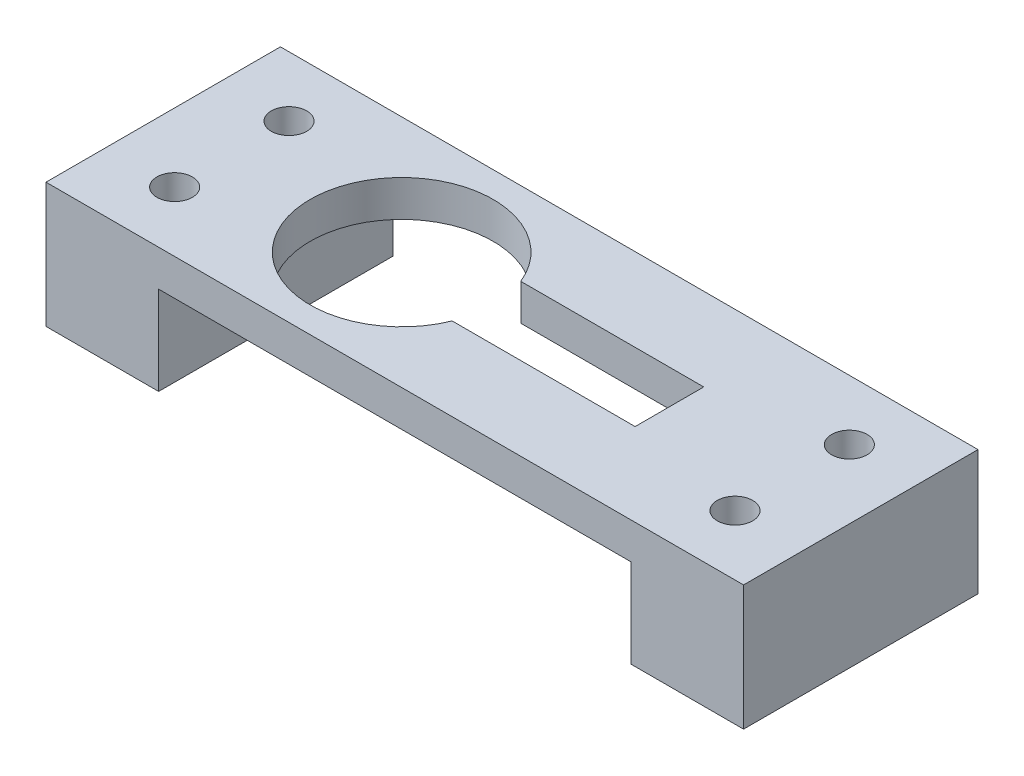
ISO-10303-21;
HEADER;
FILE_DESCRIPTION(('STEP AP214'),'2;1');
FILE_NAME('part.step','',(''),(''),'','','');
FILE_SCHEMA(('AUTOMOTIVE_DESIGN { 1 0 10303 214 1 1 1 1 }'));
ENDSEC;
DATA;
#1=APPLICATION_CONTEXT('core data for automotive mechanical design processes');
#2=APPLICATION_PROTOCOL_DEFINITION('international standard','automotive_design',2000,#1);
#3=PRODUCT_CONTEXT('',#1,'mechanical');
#4=PRODUCT('Part','Part','',(#3));
#5=PRODUCT_RELATED_PRODUCT_CATEGORY('part','',(#4));
#6=PRODUCT_DEFINITION_FORMATION('','',#4);
#7=PRODUCT_DEFINITION_CONTEXT('part definition',#1,'design');
#8=PRODUCT_DEFINITION('design','',#6,#7);
#9=PRODUCT_DEFINITION_SHAPE('','',#8);
#10=(LENGTH_UNIT() NAMED_UNIT(*) SI_UNIT(.MILLI.,.METRE.));
#11=(NAMED_UNIT(*) PLANE_ANGLE_UNIT() SI_UNIT($,.RADIAN.));
#12=(NAMED_UNIT(*) SI_UNIT($,.STERADIAN.) SOLID_ANGLE_UNIT());
#13=UNCERTAINTY_MEASURE_WITH_UNIT(LENGTH_MEASURE(1.E-05),#10,'distance_accuracy_value','');
#14=(GEOMETRIC_REPRESENTATION_CONTEXT(3) GLOBAL_UNCERTAINTY_ASSIGNED_CONTEXT((#13)) GLOBAL_UNIT_ASSIGNED_CONTEXT((#10,
#11,#12)) REPRESENTATION_CONTEXT('',''));
#15=CARTESIAN_POINT('',(0.,0.,0.));
#16=DIRECTION('',(0.,0.,1.));
#17=DIRECTION('',(1.,0.,0.));
#18=AXIS2_PLACEMENT_3D('',#15,#16,#17);
#19=CARTESIAN_POINT('',(0.,0.,0.));
#20=DIRECTION('',(0.,1.,0.));
#21=DIRECTION('',(0.,0.,1.));
#22=AXIS2_PLACEMENT_3D('',#19,#20,#21);
#23=PLANE('',#22);
#24=CARTESIAN_POINT('',(-9.65,0.,0.));
#25=DIRECTION('',(0.,1.,0.));
#26=DIRECTION('',(0.,0.,1.));
#27=AXIS2_PLACEMENT_3D('',#24,#25,#26);
#28=CIRCLE('',#27,8.);
#29=CARTESIAN_POINT('',(-2.23380151290434,0.,-3.));
#30=VERTEX_POINT('',#29);
#31=CARTESIAN_POINT('',(-2.23380151290434,0.,3.));
#32=VERTEX_POINT('',#31);
#33=EDGE_CURVE('E136',#30,#32,#28,.T.);
#34=ORIENTED_EDGE('',*,*,#33,.T.);
#35=DIRECTION('',(1.,0.,0.));
#36=VECTOR('',#35,1.);
#37=CARTESIAN_POINT('',(0.,0.,3.));
#38=LINE('',#37,#36);
#39=CARTESIAN_POINT('',(13.7661984870957,0.,3.));
#40=VERTEX_POINT('',#39);
#41=EDGE_CURVE('E145',#32,#40,#38,.T.);
#42=ORIENTED_EDGE('',*,*,#41,.T.);
#43=DIRECTION('',(0.,0.,1.));
#44=VECTOR('',#43,1.);
#45=CARTESIAN_POINT('',(13.7661984870957,0.,0.));
#46=LINE('',#45,#44);
#47=CARTESIAN_POINT('',(13.7661984870957,0.,-3.));
#48=VERTEX_POINT('',#47);
#49=EDGE_CURVE('E142',#48,#40,#46,.T.);
#50=ORIENTED_EDGE('',*,*,#49,.F.);
#51=DIRECTION('',(1.,0.,0.));
#52=VECTOR('',#51,1.);
#53=CARTESIAN_POINT('',(0.,0.,-3.));
#54=LINE('',#53,#52);
#55=EDGE_CURVE('E138',#30,#48,#54,.T.);
#56=ORIENTED_EDGE('',*,*,#55,.F.);
#57=EDGE_LOOP('',(#34,#42,#50,#56));
#58=FACE_BOUND('',#57,.T.);
#59=DIRECTION('',(0.,0.,-1.));
#60=VECTOR('',#59,1.);
#61=CARTESIAN_POINT('',(20.65,0.,10.25));
#62=LINE('',#61,#60);
#63=CARTESIAN_POINT('',(20.65,0.,10.25));
#64=VERTEX_POINT('',#63);
#65=CARTESIAN_POINT('',(20.65,0.,-10.25));
#66=VERTEX_POINT('',#65);
#67=EDGE_CURVE('E257',#64,#66,#62,.T.);
#68=ORIENTED_EDGE('',*,*,#67,.F.);
#69=DIRECTION('',(1.,0.,0.));
#70=VECTOR('',#69,1.);
#71=CARTESIAN_POINT('',(0.,0.,10.25));
#72=LINE('',#71,#70);
#73=CARTESIAN_POINT('',(-20.65,0.,10.25));
#74=VERTEX_POINT('',#73);
#75=EDGE_CURVE('E150',#74,#64,#72,.T.);
#76=ORIENTED_EDGE('',*,*,#75,.F.);
#77=DIRECTION('',(0.,0.,1.));
#78=VECTOR('',#77,1.);
#79=CARTESIAN_POINT('',(-20.65,0.,10.25));
#80=LINE('',#79,#78);
#81=CARTESIAN_POINT('',(-20.65,0.,-10.25));
#82=VERTEX_POINT('',#81);
#83=EDGE_CURVE('E54',#82,#74,#80,.T.);
#84=ORIENTED_EDGE('',*,*,#83,.F.);
#85=DIRECTION('',(1.,0.,0.));
#86=VECTOR('',#85,1.);
#87=CARTESIAN_POINT('',(0.,0.,-10.25));
#88=LINE('',#87,#86);
#89=EDGE_CURVE('E148',#82,#66,#88,.T.);
#90=ORIENTED_EDGE('',*,*,#89,.T.);
#91=EDGE_LOOP('',(#68,#76,#84,#90));
#92=FACE_BOUND('',#91,.T.);
#93=ADVANCED_FACE('F37',(#58,#92),#23,.F.);
#94=CARTESIAN_POINT('',(30.5,3.175,0.));
#95=DIRECTION('',(1.,0.,0.));
#96=DIRECTION('',(0.,0.,-1.));
#97=AXIS2_PLACEMENT_3D('',#94,#95,#96);
#98=PLANE('',#97);
#99=DIRECTION('',(0.,-1.,0.));
#100=VECTOR('',#99,1.);
#101=CARTESIAN_POINT('',(30.5,3.175,10.25));
#102=LINE('',#101,#100);
#103=CARTESIAN_POINT('',(30.5,3.175,10.25));
#104=VERTEX_POINT('',#103);
#105=CARTESIAN_POINT('',(30.5,-7.75,10.25));
#106=VERTEX_POINT('',#105);
#107=EDGE_CURVE('E154',#104,#106,#102,.T.);
#108=ORIENTED_EDGE('',*,*,#107,.T.);
#109=DIRECTION('',(0.,0.,1.));
#110=VECTOR('',#109,1.);
#111=CARTESIAN_POINT('',(30.5,-7.75,-10.25));
#112=LINE('',#111,#110);
#113=CARTESIAN_POINT('',(30.5,-7.75,-10.25));
#114=VERTEX_POINT('',#113);
#115=EDGE_CURVE('E256',#114,#106,#112,.T.);
#116=ORIENTED_EDGE('',*,*,#115,.F.);
#117=DIRECTION('',(0.,-1.,0.));
#118=VECTOR('',#117,1.);
#119=CARTESIAN_POINT('',(30.5,3.175,-10.25));
#120=LINE('',#119,#118);
#121=CARTESIAN_POINT('',(30.5,3.175,-10.25));
#122=VERTEX_POINT('',#121);
#123=EDGE_CURVE('E11',#122,#114,#120,.T.);
#124=ORIENTED_EDGE('',*,*,#123,.F.);
#125=DIRECTION('',(0.,0.,1.));
#126=VECTOR('',#125,1.);
#127=CARTESIAN_POINT('',(30.5,3.175,0.));
#128=LINE('',#127,#126);
#129=EDGE_CURVE('E129',#122,#104,#128,.T.);
#130=ORIENTED_EDGE('',*,*,#129,.T.);
#131=EDGE_LOOP('',(#108,#116,#124,#130));
#132=FACE_BOUND('',#131,.T.);
#133=ADVANCED_FACE('F184',(#132),#98,.T.);
#134=CARTESIAN_POINT('',(0.,3.175,-10.25));
#135=DIRECTION('',(0.,0.,-1.));
#136=DIRECTION('',(-1.,0.,0.));
#137=AXIS2_PLACEMENT_3D('',#134,#135,#136);
#138=PLANE('',#137);
#139=ORIENTED_EDGE('',*,*,#89,.F.);
#140=DIRECTION('',(0.,1.,0.));
#141=VECTOR('',#140,1.);
#142=CARTESIAN_POINT('',(-20.65,-7.75,-10.25));
#143=LINE('',#142,#141);
#144=CARTESIAN_POINT('',(-20.65,-7.75,-10.25));
#145=VERTEX_POINT('',#144);
#146=EDGE_CURVE('E139',#145,#82,#143,.T.);
#147=ORIENTED_EDGE('',*,*,#146,.F.);
#148=DIRECTION('',(1.,0.,0.));
#149=VECTOR('',#148,1.);
#150=CARTESIAN_POINT('',(-20.65,-7.75,-10.25));
#151=LINE('',#150,#149);
#152=CARTESIAN_POINT('',(-30.5,-7.75,-10.25));
#153=VERTEX_POINT('',#152);
#154=EDGE_CURVE('E116',#153,#145,#151,.T.);
#155=ORIENTED_EDGE('',*,*,#154,.F.);
#156=DIRECTION('',(0.,-1.,0.));
#157=VECTOR('',#156,1.);
#158=CARTESIAN_POINT('',(-30.5,3.175,-10.25));
#159=LINE('',#158,#157);
#160=CARTESIAN_POINT('',(-30.5,3.175,-10.25));
#161=VERTEX_POINT('',#160);
#162=EDGE_CURVE('E46',#161,#153,#159,.T.);
#163=ORIENTED_EDGE('',*,*,#162,.F.);
#164=DIRECTION('',(1.,0.,0.));
#165=VECTOR('',#164,1.);
#166=CARTESIAN_POINT('',(0.,3.175,-10.25));
#167=LINE('',#166,#165);
#168=EDGE_CURVE('E112',#161,#122,#167,.T.);
#169=ORIENTED_EDGE('',*,*,#168,.T.);
#170=ORIENTED_EDGE('',*,*,#123,.T.);
#171=DIRECTION('',(1.,0.,0.));
#172=VECTOR('',#171,1.);
#173=CARTESIAN_POINT('',(20.65,-7.75,-10.25));
#174=LINE('',#173,#172);
#175=CARTESIAN_POINT('',(20.65,-7.75,-10.25));
#176=VERTEX_POINT('',#175);
#177=EDGE_CURVE('E264',#176,#114,#174,.T.);
#178=ORIENTED_EDGE('',*,*,#177,.F.);
#179=DIRECTION('',(0.,1.,0.));
#180=VECTOR('',#179,1.);
#181=CARTESIAN_POINT('',(20.65,-7.75,-10.25));
#182=LINE('',#181,#180);
#183=EDGE_CURVE('E253',#176,#66,#182,.T.);
#184=ORIENTED_EDGE('',*,*,#183,.T.);
#185=EDGE_LOOP('',(#139,#147,#155,#163,#169,#170,#178,#184));
#186=FACE_BOUND('',#185,.T.);
#187=ADVANCED_FACE('F110',(#186),#138,.T.);
#188=CARTESIAN_POINT('',(-30.5,3.175,0.));
#189=DIRECTION('',(1.,0.,0.));
#190=DIRECTION('',(0.,0.,-1.));
#191=AXIS2_PLACEMENT_3D('',#188,#189,#190);
#192=PLANE('',#191);
#193=ORIENTED_EDGE('',*,*,#162,.T.);
#194=DIRECTION('',(0.,0.,-1.));
#195=VECTOR('',#194,1.);
#196=CARTESIAN_POINT('',(-30.5,-7.75,-10.25));
#197=LINE('',#196,#195);
#198=CARTESIAN_POINT('',(-30.5,-7.75,10.25));
#199=VERTEX_POINT('',#198);
#200=EDGE_CURVE('E241',#199,#153,#197,.T.);
#201=ORIENTED_EDGE('',*,*,#200,.F.);
#202=DIRECTION('',(0.,-1.,0.));
#203=VECTOR('',#202,1.);
#204=CARTESIAN_POINT('',(-30.5,3.175,10.25));
#205=LINE('',#204,#203);
#206=CARTESIAN_POINT('',(-30.5,3.175,10.25));
#207=VERTEX_POINT('',#206);
#208=EDGE_CURVE('E120',#207,#199,#205,.T.);
#209=ORIENTED_EDGE('',*,*,#208,.F.);
#210=DIRECTION('',(0.,0.,1.));
#211=VECTOR('',#210,1.);
#212=CARTESIAN_POINT('',(-30.5,3.175,0.));
#213=LINE('',#212,#211);
#214=EDGE_CURVE('E123',#161,#207,#213,.T.);
#215=ORIENTED_EDGE('',*,*,#214,.F.);
#216=EDGE_LOOP('',(#193,#201,#209,#215));
#217=FACE_BOUND('',#216,.T.);
#218=ADVANCED_FACE('F124',(#217),#192,.F.);
#219=CARTESIAN_POINT('',(-9.65,3.175,0.));
#220=DIRECTION('',(0.,-1.,0.));
#221=DIRECTION('',(0.,0.,-1.));
#222=AXIS2_PLACEMENT_3D('',#219,#220,#221);
#223=CYLINDRICAL_SURFACE('',#222,8.);
#224=ORIENTED_EDGE('',*,*,#33,.F.);
#225=DIRECTION('',(0.,-1.,0.));
#226=VECTOR('',#225,1.);
#227=CARTESIAN_POINT('',(-2.23380151290434,3.175,-3.));
#228=LINE('',#227,#226);
#229=CARTESIAN_POINT('',(-2.23380151290434,3.175,-3.));
#230=VERTEX_POINT('',#229);
#231=EDGE_CURVE('E41',#230,#30,#228,.T.);
#232=ORIENTED_EDGE('',*,*,#231,.F.);
#233=CARTESIAN_POINT('',(-9.65,3.175,0.));
#234=DIRECTION('',(0.,1.,0.));
#235=DIRECTION('',(0.,0.,1.));
#236=AXIS2_PLACEMENT_3D('',#233,#234,#235);
#237=CIRCLE('',#236,8.);
#238=CARTESIAN_POINT('',(-2.23380151290434,3.175,3.));
#239=VERTEX_POINT('',#238);
#240=EDGE_CURVE('E216',#230,#239,#237,.T.);
#241=ORIENTED_EDGE('',*,*,#240,.T.);
#242=DIRECTION('',(0.,-1.,0.));
#243=VECTOR('',#242,1.);
#244=CARTESIAN_POINT('',(-2.23380151290434,3.175,3.));
#245=LINE('',#244,#243);
#246=EDGE_CURVE('E85',#239,#32,#245,.T.);
#247=ORIENTED_EDGE('',*,*,#246,.T.);
#248=EDGE_LOOP('',(#224,#232,#241,#247));
#249=FACE_BOUND('',#248,.T.);
#250=ADVANCED_FACE('F172',(#249),#223,.F.);
#251=CARTESIAN_POINT('',(0.,3.175,-3.));
#252=DIRECTION('',(0.,0.,-1.));
#253=DIRECTION('',(-1.,0.,0.));
#254=AXIS2_PLACEMENT_3D('',#251,#252,#253);
#255=PLANE('',#254);
#256=ORIENTED_EDGE('',*,*,#55,.T.);
#257=DIRECTION('',(0.,-1.,0.));
#258=VECTOR('',#257,1.);
#259=CARTESIAN_POINT('',(13.7661984870957,3.175,-3.));
#260=LINE('',#259,#258);
#261=CARTESIAN_POINT('',(13.7661984870957,3.175,-3.));
#262=VERTEX_POINT('',#261);
#263=EDGE_CURVE('E160',#262,#48,#260,.T.);
#264=ORIENTED_EDGE('',*,*,#263,.F.);
#265=DIRECTION('',(1.,0.,0.));
#266=VECTOR('',#265,1.);
#267=CARTESIAN_POINT('',(0.,3.175,-3.));
#268=LINE('',#267,#266);
#269=EDGE_CURVE('E168',#230,#262,#268,.T.);
#270=ORIENTED_EDGE('',*,*,#269,.F.);
#271=ORIENTED_EDGE('',*,*,#231,.T.);
#272=EDGE_LOOP('',(#256,#264,#270,#271));
#273=FACE_BOUND('',#272,.T.);
#274=ADVANCED_FACE('F166',(#273),#255,.F.);
#275=CARTESIAN_POINT('',(13.7661984870957,3.175,0.));
#276=DIRECTION('',(1.,0.,0.));
#277=DIRECTION('',(0.,0.,-1.));
#278=AXIS2_PLACEMENT_3D('',#275,#276,#277);
#279=PLANE('',#278);
#280=ORIENTED_EDGE('',*,*,#49,.T.);
#281=DIRECTION('',(0.,-1.,0.));
#282=VECTOR('',#281,1.);
#283=CARTESIAN_POINT('',(13.7661984870957,3.175,3.));
#284=LINE('',#283,#282);
#285=CARTESIAN_POINT('',(13.7661984870957,3.175,3.));
#286=VERTEX_POINT('',#285);
#287=EDGE_CURVE('E159',#286,#40,#284,.T.);
#288=ORIENTED_EDGE('',*,*,#287,.F.);
#289=DIRECTION('',(0.,0.,1.));
#290=VECTOR('',#289,1.);
#291=CARTESIAN_POINT('',(13.7661984870957,3.175,0.));
#292=LINE('',#291,#290);
#293=EDGE_CURVE('E212',#262,#286,#292,.T.);
#294=ORIENTED_EDGE('',*,*,#293,.F.);
#295=ORIENTED_EDGE('',*,*,#263,.T.);
#296=EDGE_LOOP('',(#280,#288,#294,#295));
#297=FACE_BOUND('',#296,.T.);
#298=ADVANCED_FACE('F179',(#297),#279,.F.);
#299=CARTESIAN_POINT('',(0.,3.175,3.));
#300=DIRECTION('',(0.,0.,-1.));
#301=DIRECTION('',(-1.,0.,0.));
#302=AXIS2_PLACEMENT_3D('',#299,#300,#301);
#303=PLANE('',#302);
#304=ORIENTED_EDGE('',*,*,#41,.F.);
#305=ORIENTED_EDGE('',*,*,#246,.F.);
#306=DIRECTION('',(1.,0.,0.));
#307=VECTOR('',#306,1.);
#308=CARTESIAN_POINT('',(0.,3.175,3.));
#309=LINE('',#308,#307);
#310=EDGE_CURVE('E131',#239,#286,#309,.T.);
#311=ORIENTED_EDGE('',*,*,#310,.T.);
#312=ORIENTED_EDGE('',*,*,#287,.T.);
#313=EDGE_LOOP('',(#304,#305,#311,#312));
#314=FACE_BOUND('',#313,.T.);
#315=ADVANCED_FACE('F200',(#314),#303,.T.);
#316=CARTESIAN_POINT('',(-24.5,3.175,-5.));
#317=DIRECTION('',(0.,-1.,0.));
#318=DIRECTION('',(0.,0.,-1.));
#319=AXIS2_PLACEMENT_3D('',#316,#317,#318);
#320=CYLINDRICAL_SURFACE('',#319,1.55);
#321=CARTESIAN_POINT('',(-24.5,3.175,-5.));
#322=DIRECTION('',(0.,1.,0.));
#323=DIRECTION('',(0.,0.,1.));
#324=AXIS2_PLACEMENT_3D('',#321,#322,#323);
#325=CIRCLE('',#324,1.55);
#326=CARTESIAN_POINT('',(-24.5,3.175,-3.45));
#327=VERTEX_POINT('',#326);
#328=EDGE_CURVE('E218',#327,#327,#325,.T.);
#329=ORIENTED_EDGE('',*,*,#328,.T.);
#330=EDGE_LOOP('',(#329));
#331=FACE_BOUND('',#330,.T.);
#332=CARTESIAN_POINT('',(-24.5,-7.75,-5.));
#333=DIRECTION('',(0.,-1.,0.));
#334=DIRECTION('',(0.,0.,-1.));
#335=AXIS2_PLACEMENT_3D('',#332,#333,#334);
#336=CIRCLE('',#335,1.55);
#337=CARTESIAN_POINT('',(-24.5,-7.75,-6.55));
#338=VERTEX_POINT('',#337);
#339=EDGE_CURVE('E247',#338,#338,#336,.T.);
#340=ORIENTED_EDGE('',*,*,#339,.T.);
#341=EDGE_LOOP('',(#340));
#342=FACE_BOUND('',#341,.T.);
#343=ADVANCED_FACE('F203',(#331,#342),#320,.F.);
#344=CARTESIAN_POINT('',(-24.5,3.175,5.));
#345=DIRECTION('',(0.,-1.,0.));
#346=DIRECTION('',(0.,0.,-1.));
#347=AXIS2_PLACEMENT_3D('',#344,#345,#346);
#348=CYLINDRICAL_SURFACE('',#347,1.55);
#349=CARTESIAN_POINT('',(-24.5,3.175,5.));
#350=DIRECTION('',(0.,1.,0.));
#351=DIRECTION('',(0.,0.,1.));
#352=AXIS2_PLACEMENT_3D('',#349,#350,#351);
#353=CIRCLE('',#352,1.55);
#354=CARTESIAN_POINT('',(-24.5,3.175,6.55));
#355=VERTEX_POINT('',#354);
#356=EDGE_CURVE('E221',#355,#355,#353,.T.);
#357=ORIENTED_EDGE('',*,*,#356,.T.);
#358=EDGE_LOOP('',(#357));
#359=FACE_BOUND('',#358,.T.);
#360=CARTESIAN_POINT('',(-24.5,-7.75,5.));
#361=DIRECTION('',(0.,-1.,0.));
#362=DIRECTION('',(0.,0.,-1.));
#363=AXIS2_PLACEMENT_3D('',#360,#361,#362);
#364=CIRCLE('',#363,1.55);
#365=CARTESIAN_POINT('',(-24.5,-7.75,3.45));
#366=VERTEX_POINT('',#365);
#367=EDGE_CURVE('E237',#366,#366,#364,.T.);
#368=ORIENTED_EDGE('',*,*,#367,.T.);
#369=EDGE_LOOP('',(#368));
#370=FACE_BOUND('',#369,.T.);
#371=ADVANCED_FACE('F310',(#359,#370),#348,.F.);
#372=CARTESIAN_POINT('',(24.5,3.175,-5.00000000000001));
#373=DIRECTION('',(0.,-1.,0.));
#374=DIRECTION('',(0.,0.,-1.));
#375=AXIS2_PLACEMENT_3D('',#372,#373,#374);
#376=CYLINDRICAL_SURFACE('',#375,1.55);
#377=CARTESIAN_POINT('',(24.5,3.175,-5.00000000000001));
#378=DIRECTION('',(0.,1.,0.));
#379=DIRECTION('',(0.,0.,1.));
#380=AXIS2_PLACEMENT_3D('',#377,#378,#379);
#381=CIRCLE('',#380,1.55);
#382=CARTESIAN_POINT('',(24.5,3.175,-3.45000000000001));
#383=VERTEX_POINT('',#382);
#384=EDGE_CURVE('E224',#383,#383,#381,.T.);
#385=ORIENTED_EDGE('',*,*,#384,.T.);
#386=EDGE_LOOP('',(#385));
#387=FACE_BOUND('',#386,.T.);
#388=CARTESIAN_POINT('',(24.5,-7.75,-5.00000000000001));
#389=DIRECTION('',(0.,-1.,0.));
#390=DIRECTION('',(0.,0.,-1.));
#391=AXIS2_PLACEMENT_3D('',#388,#389,#390);
#392=CIRCLE('',#391,1.55);
#393=CARTESIAN_POINT('',(24.5,-7.75,-6.55000000000001));
#394=VERTEX_POINT('',#393);
#395=EDGE_CURVE('E261',#394,#394,#392,.T.);
#396=ORIENTED_EDGE('',*,*,#395,.T.);
#397=EDGE_LOOP('',(#396));
#398=FACE_BOUND('',#397,.T.);
#399=ADVANCED_FACE('F315',(#387,#398),#376,.F.);
#400=CARTESIAN_POINT('',(24.5,3.175,5.00000000000001));
#401=DIRECTION('',(0.,-1.,0.));
#402=DIRECTION('',(0.,0.,-1.));
#403=AXIS2_PLACEMENT_3D('',#400,#401,#402);
#404=CYLINDRICAL_SURFACE('',#403,1.55);
#405=CARTESIAN_POINT('',(24.5,3.175,5.00000000000001));
#406=DIRECTION('',(0.,1.,0.));
#407=DIRECTION('',(0.,0.,1.));
#408=AXIS2_PLACEMENT_3D('',#405,#406,#407);
#409=CIRCLE('',#408,1.55);
#410=CARTESIAN_POINT('',(24.5,3.175,6.55000000000001));
#411=VERTEX_POINT('',#410);
#412=EDGE_CURVE('E153',#411,#411,#409,.T.);
#413=ORIENTED_EDGE('',*,*,#412,.T.);
#414=EDGE_LOOP('',(#413));
#415=FACE_BOUND('',#414,.T.);
#416=CARTESIAN_POINT('',(24.5,-7.75,5.00000000000001));
#417=DIRECTION('',(0.,-1.,0.));
#418=DIRECTION('',(0.,0.,-1.));
#419=AXIS2_PLACEMENT_3D('',#416,#417,#418);
#420=CIRCLE('',#419,1.55);
#421=CARTESIAN_POINT('',(24.5,-7.75,3.45000000000001));
#422=VERTEX_POINT('',#421);
#423=EDGE_CURVE('E274',#422,#422,#420,.T.);
#424=ORIENTED_EDGE('',*,*,#423,.T.);
#425=EDGE_LOOP('',(#424));
#426=FACE_BOUND('',#425,.T.);
#427=ADVANCED_FACE('F39',(#415,#426),#404,.F.);
#428=CARTESIAN_POINT('',(0.,3.175,10.25));
#429=DIRECTION('',(0.,0.,-1.));
#430=DIRECTION('',(-1.,0.,0.));
#431=AXIS2_PLACEMENT_3D('',#428,#429,#430);
#432=PLANE('',#431);
#433=ORIENTED_EDGE('',*,*,#208,.T.);
#434=DIRECTION('',(-1.,0.,0.));
#435=VECTOR('',#434,1.);
#436=CARTESIAN_POINT('',(-30.5,-7.75,10.25));
#437=LINE('',#436,#435);
#438=CARTESIAN_POINT('',(-20.65,-7.75,10.25));
#439=VERTEX_POINT('',#438);
#440=EDGE_CURVE('E236',#439,#199,#437,.T.);
#441=ORIENTED_EDGE('',*,*,#440,.F.);
#442=DIRECTION('',(0.,1.,0.));
#443=VECTOR('',#442,1.);
#444=CARTESIAN_POINT('',(-20.65,-7.75,10.25));
#445=LINE('',#444,#443);
#446=EDGE_CURVE('E231',#439,#74,#445,.T.);
#447=ORIENTED_EDGE('',*,*,#446,.T.);
#448=ORIENTED_EDGE('',*,*,#75,.T.);
#449=DIRECTION('',(0.,1.,0.));
#450=VECTOR('',#449,1.);
#451=CARTESIAN_POINT('',(20.65,-7.75,10.25));
#452=LINE('',#451,#450);
#453=CARTESIAN_POINT('',(20.65,-7.75,10.25));
#454=VERTEX_POINT('',#453);
#455=EDGE_CURVE('E250',#454,#64,#452,.T.);
#456=ORIENTED_EDGE('',*,*,#455,.F.);
#457=DIRECTION('',(-1.,0.,0.));
#458=VECTOR('',#457,1.);
#459=CARTESIAN_POINT('',(30.5,-7.75,10.25));
#460=LINE('',#459,#458);
#461=EDGE_CURVE('E260',#106,#454,#460,.T.);
#462=ORIENTED_EDGE('',*,*,#461,.F.);
#463=ORIENTED_EDGE('',*,*,#107,.F.);
#464=DIRECTION('',(1.,0.,0.));
#465=VECTOR('',#464,1.);
#466=CARTESIAN_POINT('',(0.,3.175,10.25));
#467=LINE('',#466,#465);
#468=EDGE_CURVE('E63',#207,#104,#467,.T.);
#469=ORIENTED_EDGE('',*,*,#468,.F.);
#470=EDGE_LOOP('',(#433,#441,#447,#448,#456,#462,#463,#469));
#471=FACE_BOUND('',#470,.T.);
#472=ADVANCED_FACE('F194',(#471),#432,.F.);
#473=CARTESIAN_POINT('',(0.,3.175,0.));
#474=DIRECTION('',(0.,1.,0.));
#475=DIRECTION('',(0.,0.,1.));
#476=AXIS2_PLACEMENT_3D('',#473,#474,#475);
#477=PLANE('',#476);
#478=ORIENTED_EDGE('',*,*,#412,.F.);
#479=EDGE_LOOP('',(#478));
#480=FACE_BOUND('',#479,.T.);
#481=ORIENTED_EDGE('',*,*,#384,.F.);
#482=EDGE_LOOP('',(#481));
#483=FACE_BOUND('',#482,.T.);
#484=ORIENTED_EDGE('',*,*,#356,.F.);
#485=EDGE_LOOP('',(#484));
#486=FACE_BOUND('',#485,.T.);
#487=ORIENTED_EDGE('',*,*,#328,.F.);
#488=EDGE_LOOP('',(#487));
#489=FACE_BOUND('',#488,.T.);
#490=ORIENTED_EDGE('',*,*,#240,.F.);
#491=ORIENTED_EDGE('',*,*,#269,.T.);
#492=ORIENTED_EDGE('',*,*,#293,.T.);
#493=ORIENTED_EDGE('',*,*,#310,.F.);
#494=EDGE_LOOP('',(#490,#491,#492,#493));
#495=FACE_BOUND('',#494,.T.);
#496=ORIENTED_EDGE('',*,*,#129,.F.);
#497=ORIENTED_EDGE('',*,*,#168,.F.);
#498=ORIENTED_EDGE('',*,*,#214,.T.);
#499=ORIENTED_EDGE('',*,*,#468,.T.);
#500=EDGE_LOOP('',(#496,#497,#498,#499));
#501=FACE_BOUND('',#500,.T.);
#502=ADVANCED_FACE('F127',(#480,#483,#486,#489,#495,#501),#477,.T.);
#503=CARTESIAN_POINT('',(0.,-7.75,0.));
#504=DIRECTION('',(0.,1.,0.));
#505=DIRECTION('',(0.,0.,1.));
#506=AXIS2_PLACEMENT_3D('',#503,#504,#505);
#507=PLANE('',#506);
#508=ORIENTED_EDGE('',*,*,#440,.T.);
#509=ORIENTED_EDGE('',*,*,#200,.T.);
#510=ORIENTED_EDGE('',*,*,#154,.T.);
#511=DIRECTION('',(0.,0.,1.));
#512=VECTOR('',#511,1.);
#513=CARTESIAN_POINT('',(-20.65,-7.75,10.25));
#514=LINE('',#513,#512);
#515=EDGE_CURVE('E234',#145,#439,#514,.T.);
#516=ORIENTED_EDGE('',*,*,#515,.T.);
#517=EDGE_LOOP('',(#508,#509,#510,#516));
#518=FACE_BOUND('',#517,.T.);
#519=ORIENTED_EDGE('',*,*,#367,.F.);
#520=EDGE_LOOP('',(#519));
#521=FACE_BOUND('',#520,.T.);
#522=ORIENTED_EDGE('',*,*,#339,.F.);
#523=EDGE_LOOP('',(#522));
#524=FACE_BOUND('',#523,.T.);
#525=ADVANCED_FACE('F291',(#518,#521,#524),#507,.F.);
#526=CARTESIAN_POINT('',(-20.65,-7.75,10.25));
#527=DIRECTION('',(-1.,0.,0.));
#528=DIRECTION('',(0.,0.,1.));
#529=AXIS2_PLACEMENT_3D('',#526,#527,#528);
#530=PLANE('',#529);
#531=ORIENTED_EDGE('',*,*,#83,.T.);
#532=ORIENTED_EDGE('',*,*,#446,.F.);
#533=ORIENTED_EDGE('',*,*,#515,.F.);
#534=ORIENTED_EDGE('',*,*,#146,.T.);
#535=EDGE_LOOP('',(#531,#532,#533,#534));
#536=FACE_BOUND('',#535,.T.);
#537=ADVANCED_FACE('F282',(#536),#530,.F.);
#538=CARTESIAN_POINT('',(0.,-7.75,0.));
#539=DIRECTION('',(0.,-1.,0.));
#540=DIRECTION('',(0.,0.,-1.));
#541=AXIS2_PLACEMENT_3D('',#538,#539,#540);
#542=PLANE('',#541);
#543=ORIENTED_EDGE('',*,*,#395,.F.);
#544=EDGE_LOOP('',(#543));
#545=FACE_BOUND('',#544,.T.);
#546=ORIENTED_EDGE('',*,*,#461,.T.);
#547=DIRECTION('',(0.,0.,-1.));
#548=VECTOR('',#547,1.);
#549=CARTESIAN_POINT('',(20.65,-7.75,10.25));
#550=LINE('',#549,#548);
#551=EDGE_CURVE('E267',#454,#176,#550,.T.);
#552=ORIENTED_EDGE('',*,*,#551,.T.);
#553=ORIENTED_EDGE('',*,*,#177,.T.);
#554=ORIENTED_EDGE('',*,*,#115,.T.);
#555=EDGE_LOOP('',(#546,#552,#553,#554));
#556=FACE_BOUND('',#555,.T.);
#557=ORIENTED_EDGE('',*,*,#423,.F.);
#558=EDGE_LOOP('',(#557));
#559=FACE_BOUND('',#558,.T.);
#560=ADVANCED_FACE('F279',(#545,#556,#559),#542,.T.);
#561=CARTESIAN_POINT('',(20.65,-7.75,10.25));
#562=DIRECTION('',(1.,0.,0.));
#563=DIRECTION('',(0.,0.,-1.));
#564=AXIS2_PLACEMENT_3D('',#561,#562,#563);
#565=PLANE('',#564);
#566=ORIENTED_EDGE('',*,*,#67,.T.);
#567=ORIENTED_EDGE('',*,*,#183,.F.);
#568=ORIENTED_EDGE('',*,*,#551,.F.);
#569=ORIENTED_EDGE('',*,*,#455,.T.);
#570=EDGE_LOOP('',(#566,#567,#568,#569));
#571=FACE_BOUND('',#570,.T.);
#572=ADVANCED_FACE('F281',(#571),#565,.F.);
#573=CLOSED_SHELL('',(#93,#133,#187,#218,#250,#274,#298,#315,#343,#371,#399,#427,#472,#502,#525,
#537,#560,#572));
#574=MANIFOLD_SOLID_BREP('B2',#573);
#575=ADVANCED_BREP_SHAPE_REPRESENTATION('',(#18,#574),#14);
#576=SHAPE_DEFINITION_REPRESENTATION(#9,#575);
ENDSEC;
END-ISO-10303-21;
